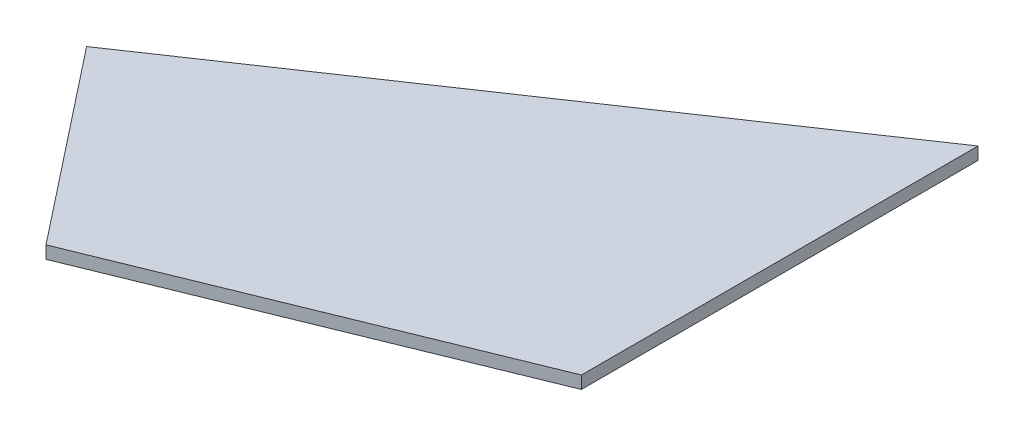
ISO-10303-21;
HEADER;
FILE_DESCRIPTION(('STEP AP214'),'2;1');
FILE_NAME('part.step','',(''),(''),'','','');
FILE_SCHEMA(('AUTOMOTIVE_DESIGN { 1 0 10303 214 1 1 1 1 }'));
ENDSEC;
DATA;
#1=APPLICATION_CONTEXT('core data for automotive mechanical design processes');
#2=APPLICATION_PROTOCOL_DEFINITION('international standard','automotive_design',2000,#1);
#3=PRODUCT_CONTEXT('',#1,'mechanical');
#4=PRODUCT('Part','Part','',(#3));
#5=PRODUCT_RELATED_PRODUCT_CATEGORY('part','',(#4));
#6=PRODUCT_DEFINITION_FORMATION('','',#4);
#7=PRODUCT_DEFINITION_CONTEXT('part definition',#1,'design');
#8=PRODUCT_DEFINITION('design','',#6,#7);
#9=PRODUCT_DEFINITION_SHAPE('','',#8);
#10=(LENGTH_UNIT() NAMED_UNIT(*) SI_UNIT(.MILLI.,.METRE.));
#11=(NAMED_UNIT(*) PLANE_ANGLE_UNIT() SI_UNIT($,.RADIAN.));
#12=(NAMED_UNIT(*) SI_UNIT($,.STERADIAN.) SOLID_ANGLE_UNIT());
#13=UNCERTAINTY_MEASURE_WITH_UNIT(LENGTH_MEASURE(1.E-05),#10,'distance_accuracy_value','');
#14=(GEOMETRIC_REPRESENTATION_CONTEXT(3) GLOBAL_UNCERTAINTY_ASSIGNED_CONTEXT((#13)) GLOBAL_UNIT_ASSIGNED_CONTEXT((#10,
#11,#12)) REPRESENTATION_CONTEXT('',''));
#15=CARTESIAN_POINT('',(0.,0.,0.));
#16=DIRECTION('',(0.,0.,1.));
#17=DIRECTION('',(1.,0.,0.));
#18=AXIS2_PLACEMENT_3D('',#15,#16,#17);
#19=CARTESIAN_POINT('',(60.5952186534705,2.,-24.6906902436762));
#20=DIRECTION('',(-1.,0.,0.));
#21=DIRECTION('',(0.,0.,1.));
#22=AXIS2_PLACEMENT_3D('',#19,#20,#21);
#23=PLANE('',#22);
#24=DIRECTION('',(0.,0.,-1.));
#25=VECTOR('',#24,1.);
#26=CARTESIAN_POINT('',(60.5952186534705,0.,-24.6906902436762));
#27=LINE('',#26,#25);
#28=CARTESIAN_POINT('',(60.5952186534705,0.,-24.6906902436762));
#29=VERTEX_POINT('',#28);
#30=CARTESIAN_POINT('',(60.5952186534705,0.,-87.8675598208296));
#31=VERTEX_POINT('',#30);
#32=EDGE_CURVE('E107',#29,#31,#27,.T.);
#33=ORIENTED_EDGE('',*,*,#32,.T.);
#34=DIRECTION('',(0.,-1.,0.));
#35=VECTOR('',#34,1.);
#36=CARTESIAN_POINT('',(60.5952186534705,2.,-87.8675598208296));
#37=LINE('',#36,#35);
#38=CARTESIAN_POINT('',(60.5952186534705,2.,-87.8675598208296));
#39=VERTEX_POINT('',#38);
#40=EDGE_CURVE('E11',#39,#31,#37,.T.);
#41=ORIENTED_EDGE('',*,*,#40,.F.);
#42=DIRECTION('',(0.,0.,-1.));
#43=VECTOR('',#42,1.);
#44=CARTESIAN_POINT('',(60.5952186534705,2.,-24.6906902436762));
#45=LINE('',#44,#43);
#46=CARTESIAN_POINT('',(60.5952186534705,2.,-24.6906902436762));
#47=VERTEX_POINT('',#46);
#48=EDGE_CURVE('E91',#47,#39,#45,.T.);
#49=ORIENTED_EDGE('',*,*,#48,.F.);
#50=DIRECTION('',(0.,-1.,0.));
#51=VECTOR('',#50,1.);
#52=CARTESIAN_POINT('',(60.5952186534705,2.,-24.6906902436762));
#53=LINE('',#52,#51);
#54=EDGE_CURVE('E103',#47,#29,#53,.T.);
#55=ORIENTED_EDGE('',*,*,#54,.T.);
#56=EDGE_LOOP('',(#33,#41,#49,#55));
#57=FACE_BOUND('',#56,.T.);
#58=ADVANCED_FACE('F39',(#57),#23,.F.);
#59=CARTESIAN_POINT('',(60.5952186534705,2.,-87.8675598208296));
#60=DIRECTION('',(0.56005760930625,0.,0.828453664520936));
#61=DIRECTION('',(0.828453664520936,0.,-0.56005760930625));
#62=AXIS2_PLACEMENT_3D('',#59,#60,#61);
#63=PLANE('',#62);
#64=DIRECTION('',(-0.828453664520936,0.,0.56005760930625));
#65=VECTOR('',#64,1.);
#66=CARTESIAN_POINT('',(60.5952186534705,0.,-87.8675598208296));
#67=LINE('',#66,#65);
#68=CARTESIAN_POINT('',(-24.1275393594158,0.,-30.5926302277939));
#69=VERTEX_POINT('',#68);
#70=EDGE_CURVE('E96',#31,#69,#67,.T.);
#71=ORIENTED_EDGE('',*,*,#70,.T.);
#72=DIRECTION('',(0.,-1.,0.));
#73=VECTOR('',#72,1.);
#74=CARTESIAN_POINT('',(-24.1275393594158,2.,-30.5926302277939));
#75=LINE('',#74,#73);
#76=CARTESIAN_POINT('',(-24.1275393594158,2.,-30.5926302277939));
#77=VERTEX_POINT('',#76);
#78=EDGE_CURVE('E48',#77,#69,#75,.T.);
#79=ORIENTED_EDGE('',*,*,#78,.F.);
#80=DIRECTION('',(-0.828453664520936,0.,0.56005760930625));
#81=VECTOR('',#80,1.);
#82=CARTESIAN_POINT('',(60.5952186534705,2.,-87.8675598208296));
#83=LINE('',#82,#81);
#84=EDGE_CURVE('E86',#39,#77,#83,.T.);
#85=ORIENTED_EDGE('',*,*,#84,.F.);
#86=ORIENTED_EDGE('',*,*,#40,.T.);
#87=EDGE_LOOP('',(#71,#79,#85,#86));
#88=FACE_BOUND('',#87,.T.);
#89=ADVANCED_FACE('F95',(#88),#63,.F.);
#90=CARTESIAN_POINT('',(-24.1275393594158,2.,-30.5926302277939));
#91=DIRECTION('',(0.785188956592165,0.,-0.619256249419985));
#92=DIRECTION('',(-0.619256249419985,0.,-0.785188956592165));
#93=AXIS2_PLACEMENT_3D('',#90,#91,#92);
#94=PLANE('',#93);
#95=DIRECTION('',(0.619256249419985,0.,0.785188956592165));
#96=VECTOR('',#95,1.);
#97=CARTESIAN_POINT('',(-24.1275393594158,0.,-30.5926302277939));
#98=LINE('',#97,#96);
#99=CARTESIAN_POINT('',(0.,0.,0.));
#100=VERTEX_POINT('',#99);
#101=EDGE_CURVE('E73',#69,#100,#98,.T.);
#102=ORIENTED_EDGE('',*,*,#101,.T.);
#103=DIRECTION('',(0.,-1.,0.));
#104=VECTOR('',#103,1.);
#105=CARTESIAN_POINT('',(0.,2.,0.));
#106=LINE('',#105,#104);
#107=CARTESIAN_POINT('',(0.,2.,0.));
#108=VERTEX_POINT('',#107);
#109=EDGE_CURVE('E98',#108,#100,#106,.T.);
#110=ORIENTED_EDGE('',*,*,#109,.F.);
#111=DIRECTION('',(0.619256249419985,0.,0.785188956592165));
#112=VECTOR('',#111,1.);
#113=CARTESIAN_POINT('',(-24.1275393594158,2.,-30.5926302277939));
#114=LINE('',#113,#112);
#115=EDGE_CURVE('E89',#77,#108,#114,.T.);
#116=ORIENTED_EDGE('',*,*,#115,.F.);
#117=ORIENTED_EDGE('',*,*,#78,.T.);
#118=EDGE_LOOP('',(#102,#110,#116,#117));
#119=FACE_BOUND('',#118,.T.);
#120=ADVANCED_FACE('F99',(#119),#94,.F.);
#121=CARTESIAN_POINT('',(0.,2.,0.));
#122=DIRECTION('',(-0.377346030340465,0.,-0.926072337016009));
#123=DIRECTION('',(-0.926072337016009,0.,0.377346030340465));
#124=AXIS2_PLACEMENT_3D('',#121,#122,#123);
#125=PLANE('',#124);
#126=DIRECTION('',(0.926072337016009,0.,-0.377346030340465));
#127=VECTOR('',#126,1.);
#128=CARTESIAN_POINT('',(0.,0.,0.));
#129=LINE('',#128,#127);
#130=EDGE_CURVE('E79',#100,#29,#129,.T.);
#131=ORIENTED_EDGE('',*,*,#130,.T.);
#132=ORIENTED_EDGE('',*,*,#54,.F.);
#133=DIRECTION('',(0.926072337016009,0.,-0.377346030340465));
#134=VECTOR('',#133,1.);
#135=CARTESIAN_POINT('',(0.,2.,0.));
#136=LINE('',#135,#134);
#137=EDGE_CURVE('E56',#108,#47,#136,.T.);
#138=ORIENTED_EDGE('',*,*,#137,.F.);
#139=ORIENTED_EDGE('',*,*,#109,.T.);
#140=EDGE_LOOP('',(#131,#132,#138,#139));
#141=FACE_BOUND('',#140,.T.);
#142=ADVANCED_FACE('F120',(#141),#125,.F.);
#143=CARTESIAN_POINT('',(0.,2.,0.));
#144=DIRECTION('',(0.,-1.,0.));
#145=DIRECTION('',(0.,0.,-1.));
#146=AXIS2_PLACEMENT_3D('',#143,#144,#145);
#147=PLANE('',#146);
#148=ORIENTED_EDGE('',*,*,#48,.T.);
#149=ORIENTED_EDGE('',*,*,#84,.T.);
#150=ORIENTED_EDGE('',*,*,#115,.T.);
#151=ORIENTED_EDGE('',*,*,#137,.T.);
#152=EDGE_LOOP('',(#148,#149,#150,#151));
#153=FACE_BOUND('',#152,.T.);
#154=ADVANCED_FACE('F87',(#153),#147,.F.);
#155=CARTESIAN_POINT('',(0.,0.,0.));
#156=DIRECTION('',(0.,-1.,0.));
#157=DIRECTION('',(0.,0.,-1.));
#158=AXIS2_PLACEMENT_3D('',#155,#156,#157);
#159=PLANE('',#158);
#160=ORIENTED_EDGE('',*,*,#32,.F.);
#161=ORIENTED_EDGE('',*,*,#130,.F.);
#162=ORIENTED_EDGE('',*,*,#101,.F.);
#163=ORIENTED_EDGE('',*,*,#70,.F.);
#164=EDGE_LOOP('',(#160,#161,#162,#163));
#165=FACE_BOUND('',#164,.T.);
#166=ADVANCED_FACE('F123',(#165),#159,.T.);
#167=CLOSED_SHELL('',(#58,#89,#120,#142,#154,#166));
#168=MANIFOLD_SOLID_BREP('B2',#167);
#169=ADVANCED_BREP_SHAPE_REPRESENTATION('',(#18,#168),#14);
#170=SHAPE_DEFINITION_REPRESENTATION(#9,#169);
ENDSEC;
END-ISO-10303-21;
